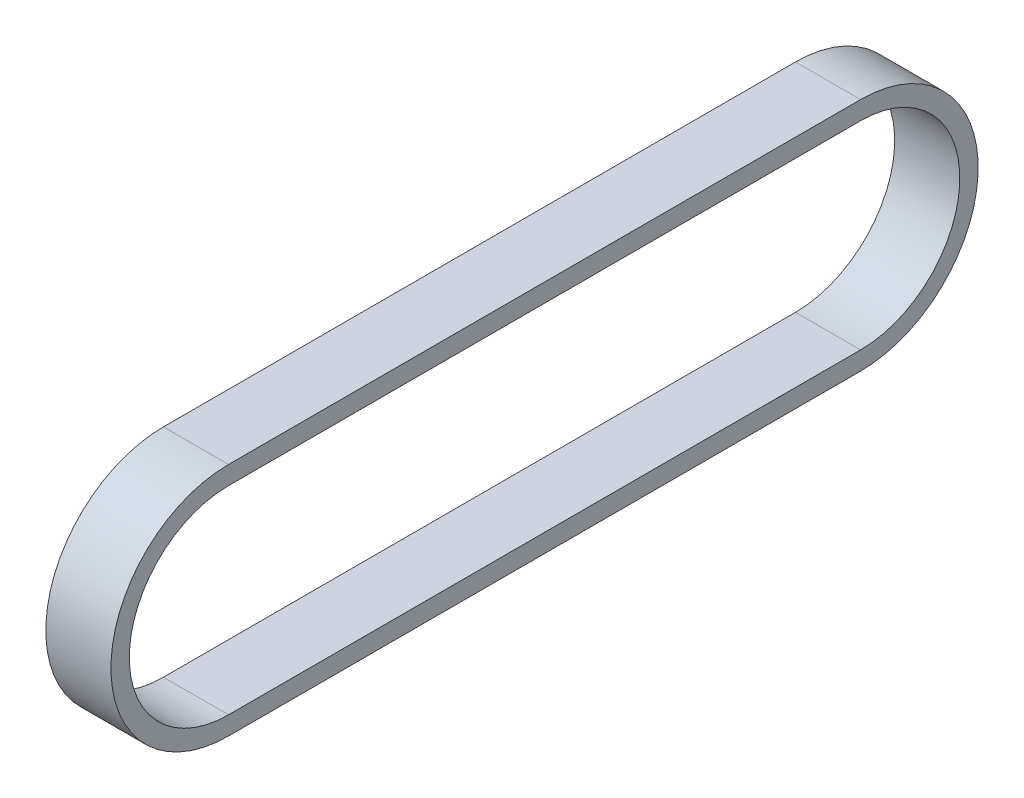
ISO-10303-21;
HEADER;
FILE_DESCRIPTION(('STEP AP214'),'2;1');
FILE_NAME('part.step','',(''),(''),'','','');
FILE_SCHEMA(('AUTOMOTIVE_DESIGN { 1 0 10303 214 1 1 1 1 }'));
ENDSEC;
DATA;
#1=APPLICATION_CONTEXT('core data for automotive mechanical design processes');
#2=APPLICATION_PROTOCOL_DEFINITION('international standard','automotive_design',2000,#1);
#3=PRODUCT_CONTEXT('',#1,'mechanical');
#4=PRODUCT('Part','Part','',(#3));
#5=PRODUCT_RELATED_PRODUCT_CATEGORY('part','',(#4));
#6=PRODUCT_DEFINITION_FORMATION('','',#4);
#7=PRODUCT_DEFINITION_CONTEXT('part definition',#1,'design');
#8=PRODUCT_DEFINITION('design','',#6,#7);
#9=PRODUCT_DEFINITION_SHAPE('','',#8);
#10=(LENGTH_UNIT() NAMED_UNIT(*) SI_UNIT(.MILLI.,.METRE.));
#11=(NAMED_UNIT(*) PLANE_ANGLE_UNIT() SI_UNIT($,.RADIAN.));
#12=(NAMED_UNIT(*) SI_UNIT($,.STERADIAN.) SOLID_ANGLE_UNIT());
#13=UNCERTAINTY_MEASURE_WITH_UNIT(LENGTH_MEASURE(1.E-05),#10,'distance_accuracy_value','');
#14=(GEOMETRIC_REPRESENTATION_CONTEXT(3) GLOBAL_UNCERTAINTY_ASSIGNED_CONTEXT((#13)) GLOBAL_UNIT_ASSIGNED_CONTEXT((#10,
#11,#12)) REPRESENTATION_CONTEXT('',''));
#15=CARTESIAN_POINT('',(0.,0.,0.));
#16=DIRECTION('',(0.,0.,1.));
#17=DIRECTION('',(1.,0.,0.));
#18=AXIS2_PLACEMENT_3D('',#15,#16,#17);
#19=CARTESIAN_POINT('',(9.,0.,0.));
#20=DIRECTION('',(1.,0.,0.));
#21=DIRECTION('',(0.,0.,-1.));
#22=AXIS2_PLACEMENT_3D('',#19,#20,#21);
#23=PLANE('',#22);
#24=CARTESIAN_POINT('',(9.,0.,0.));
#25=DIRECTION('',(1.,0.,0.));
#26=DIRECTION('',(0.,0.,-1.));
#27=AXIS2_PLACEMENT_3D('',#24,#25,#26);
#28=CIRCLE('',#27,16.256);
#29=CARTESIAN_POINT('',(9.,16.256,0.));
#30=VERTEX_POINT('',#29);
#31=CARTESIAN_POINT('',(9.,-16.256,0.));
#32=VERTEX_POINT('',#31);
#33=EDGE_CURVE('E158',#30,#32,#28,.T.);
#34=ORIENTED_EDGE('',*,*,#33,.T.);
#35=DIRECTION('',(0.,0.,-1.));
#36=VECTOR('',#35,1.);
#37=CARTESIAN_POINT('',(9.,-16.256,0.));
#38=LINE('',#37,#36);
#39=CARTESIAN_POINT('',(9.,-16.256,-87.376));
#40=VERTEX_POINT('',#39);
#41=EDGE_CURVE('E161',#32,#40,#38,.T.);
#42=ORIENTED_EDGE('',*,*,#41,.T.);
#43=CARTESIAN_POINT('',(9.,0.,-87.376));
#44=DIRECTION('',(1.,0.,0.));
#45=DIRECTION('',(0.,0.,-1.));
#46=AXIS2_PLACEMENT_3D('',#43,#44,#45);
#47=CIRCLE('',#46,16.256);
#48=CARTESIAN_POINT('',(9.,16.256,-87.376));
#49=VERTEX_POINT('',#48);
#50=EDGE_CURVE('E164',#40,#49,#47,.T.);
#51=ORIENTED_EDGE('',*,*,#50,.T.);
#52=DIRECTION('',(0.,0.,1.));
#53=VECTOR('',#52,1.);
#54=CARTESIAN_POINT('',(9.,16.256,0.));
#55=LINE('',#54,#53);
#56=EDGE_CURVE('E166',#49,#30,#55,.T.);
#57=ORIENTED_EDGE('',*,*,#56,.T.);
#58=EDGE_LOOP('',(#34,#42,#51,#57));
#59=FACE_BOUND('',#58,.T.);
#60=DIRECTION('',(0.,0.,-1.));
#61=VECTOR('',#60,1.);
#62=CARTESIAN_POINT('',(9.,-13.716,0.));
#63=LINE('',#62,#61);
#64=CARTESIAN_POINT('',(9.,-13.716,0.));
#65=VERTEX_POINT('',#64);
#66=CARTESIAN_POINT('',(9.,-13.716,-87.376));
#67=VERTEX_POINT('',#66);
#68=EDGE_CURVE('E130',#65,#67,#63,.T.);
#69=ORIENTED_EDGE('',*,*,#68,.F.);
#70=CARTESIAN_POINT('',(9.,0.,0.));
#71=DIRECTION('',(1.,0.,0.));
#72=DIRECTION('',(0.,0.,-1.));
#73=AXIS2_PLACEMENT_3D('',#70,#71,#72);
#74=CIRCLE('',#73,13.716);
#75=CARTESIAN_POINT('',(9.,13.716,0.));
#76=VERTEX_POINT('',#75);
#77=EDGE_CURVE('E122',#76,#65,#74,.T.);
#78=ORIENTED_EDGE('',*,*,#77,.F.);
#79=DIRECTION('',(0.,0.,1.));
#80=VECTOR('',#79,1.);
#81=CARTESIAN_POINT('',(9.,13.716,0.));
#82=LINE('',#81,#80);
#83=CARTESIAN_POINT('',(9.,13.716,-87.376));
#84=VERTEX_POINT('',#83);
#85=EDGE_CURVE('E144',#84,#76,#82,.T.);
#86=ORIENTED_EDGE('',*,*,#85,.F.);
#87=CARTESIAN_POINT('',(9.,0.,-87.376));
#88=DIRECTION('',(1.,0.,0.));
#89=DIRECTION('',(0.,0.,-1.));
#90=AXIS2_PLACEMENT_3D('',#87,#88,#89);
#91=CIRCLE('',#90,13.716);
#92=EDGE_CURVE('E142',#67,#84,#91,.T.);
#93=ORIENTED_EDGE('',*,*,#92,.F.);
#94=EDGE_LOOP('',(#69,#78,#86,#93));
#95=FACE_BOUND('',#94,.T.);
#96=ADVANCED_FACE('F57',(#59,#95),#23,.T.);
#97=CARTESIAN_POINT('',(0.,0.,0.));
#98=DIRECTION('',(1.,0.,0.));
#99=DIRECTION('',(0.,0.,-1.));
#100=AXIS2_PLACEMENT_3D('',#97,#98,#99);
#101=PLANE('',#100);
#102=CARTESIAN_POINT('',(0.,0.,0.));
#103=DIRECTION('',(1.,0.,0.));
#104=DIRECTION('',(0.,0.,-1.));
#105=AXIS2_PLACEMENT_3D('',#102,#103,#104);
#106=CIRCLE('',#105,16.256);
#107=CARTESIAN_POINT('',(0.,16.256,0.));
#108=VERTEX_POINT('',#107);
#109=CARTESIAN_POINT('',(0.,-16.256,0.));
#110=VERTEX_POINT('',#109);
#111=EDGE_CURVE('E138',#108,#110,#106,.T.);
#112=ORIENTED_EDGE('',*,*,#111,.F.);
#113=DIRECTION('',(0.,0.,1.));
#114=VECTOR('',#113,1.);
#115=CARTESIAN_POINT('',(0.,16.256,0.));
#116=LINE('',#115,#114);
#117=CARTESIAN_POINT('',(0.,16.256,-87.376));
#118=VERTEX_POINT('',#117);
#119=EDGE_CURVE('E162',#118,#108,#116,.T.);
#120=ORIENTED_EDGE('',*,*,#119,.F.);
#121=CARTESIAN_POINT('',(0.,0.,-87.376));
#122=DIRECTION('',(1.,0.,0.));
#123=DIRECTION('',(0.,0.,-1.));
#124=AXIS2_PLACEMENT_3D('',#121,#122,#123);
#125=CIRCLE('',#124,16.256);
#126=CARTESIAN_POINT('',(0.,-16.256,-87.376));
#127=VERTEX_POINT('',#126);
#128=EDGE_CURVE('E173',#127,#118,#125,.T.);
#129=ORIENTED_EDGE('',*,*,#128,.F.);
#130=DIRECTION('',(0.,0.,-1.));
#131=VECTOR('',#130,1.);
#132=CARTESIAN_POINT('',(0.,-16.256,0.));
#133=LINE('',#132,#131);
#134=EDGE_CURVE('E171',#110,#127,#133,.T.);
#135=ORIENTED_EDGE('',*,*,#134,.F.);
#136=EDGE_LOOP('',(#112,#120,#129,#135));
#137=FACE_BOUND('',#136,.T.);
#138=CARTESIAN_POINT('',(0.,0.,0.));
#139=DIRECTION('',(1.,0.,0.));
#140=DIRECTION('',(0.,0.,-1.));
#141=AXIS2_PLACEMENT_3D('',#138,#139,#140);
#142=CIRCLE('',#141,13.716);
#143=CARTESIAN_POINT('',(0.,13.716,0.));
#144=VERTEX_POINT('',#143);
#145=CARTESIAN_POINT('',(0.,-13.716,0.));
#146=VERTEX_POINT('',#145);
#147=EDGE_CURVE('E80',#144,#146,#142,.T.);
#148=ORIENTED_EDGE('',*,*,#147,.T.);
#149=DIRECTION('',(0.,0.,-1.));
#150=VECTOR('',#149,1.);
#151=CARTESIAN_POINT('',(0.,-13.716,0.));
#152=LINE('',#151,#150);
#153=CARTESIAN_POINT('',(0.,-13.716,-87.376));
#154=VERTEX_POINT('',#153);
#155=EDGE_CURVE('E137',#146,#154,#152,.T.);
#156=ORIENTED_EDGE('',*,*,#155,.T.);
#157=CARTESIAN_POINT('',(0.,0.,-87.376));
#158=DIRECTION('',(1.,0.,0.));
#159=DIRECTION('',(0.,0.,-1.));
#160=AXIS2_PLACEMENT_3D('',#157,#158,#159);
#161=CIRCLE('',#160,13.716);
#162=CARTESIAN_POINT('',(0.,13.716,-87.376));
#163=VERTEX_POINT('',#162);
#164=EDGE_CURVE('E150',#154,#163,#161,.T.);
#165=ORIENTED_EDGE('',*,*,#164,.T.);
#166=DIRECTION('',(0.,0.,1.));
#167=VECTOR('',#166,1.);
#168=CARTESIAN_POINT('',(0.,13.716,0.));
#169=LINE('',#168,#167);
#170=EDGE_CURVE('E131',#163,#144,#169,.T.);
#171=ORIENTED_EDGE('',*,*,#170,.T.);
#172=EDGE_LOOP('',(#148,#156,#165,#171));
#173=FACE_BOUND('',#172,.T.);
#174=ADVANCED_FACE('F191',(#137,#173),#101,.F.);
#175=CARTESIAN_POINT('',(9.,0.,0.));
#176=DIRECTION('',(-1.,0.,0.));
#177=DIRECTION('',(0.,0.,1.));
#178=AXIS2_PLACEMENT_3D('',#175,#176,#177);
#179=CYLINDRICAL_SURFACE('',#178,16.256);
#180=ORIENTED_EDGE('',*,*,#111,.T.);
#181=DIRECTION('',(-1.,0.,0.));
#182=VECTOR('',#181,1.);
#183=CARTESIAN_POINT('',(9.,-16.256,0.));
#184=LINE('',#183,#182);
#185=EDGE_CURVE('E12',#32,#110,#184,.T.);
#186=ORIENTED_EDGE('',*,*,#185,.F.);
#187=ORIENTED_EDGE('',*,*,#33,.F.);
#188=DIRECTION('',(-1.,0.,0.));
#189=VECTOR('',#188,1.);
#190=CARTESIAN_POINT('',(9.,16.256,0.));
#191=LINE('',#190,#189);
#192=EDGE_CURVE('E168',#30,#108,#191,.T.);
#193=ORIENTED_EDGE('',*,*,#192,.T.);
#194=EDGE_LOOP('',(#180,#186,#187,#193));
#195=FACE_BOUND('',#194,.T.);
#196=ADVANCED_FACE('F59',(#195),#179,.T.);
#197=CARTESIAN_POINT('',(9.,-16.256,0.));
#198=DIRECTION('',(0.,1.,0.));
#199=DIRECTION('',(0.,0.,1.));
#200=AXIS2_PLACEMENT_3D('',#197,#198,#199);
#201=PLANE('',#200);
#202=ORIENTED_EDGE('',*,*,#134,.T.);
#203=DIRECTION('',(-1.,0.,0.));
#204=VECTOR('',#203,1.);
#205=CARTESIAN_POINT('',(9.,-16.256,-87.376));
#206=LINE('',#205,#204);
#207=EDGE_CURVE('E65',#40,#127,#206,.T.);
#208=ORIENTED_EDGE('',*,*,#207,.F.);
#209=ORIENTED_EDGE('',*,*,#41,.F.);
#210=ORIENTED_EDGE('',*,*,#185,.T.);
#211=EDGE_LOOP('',(#202,#208,#209,#210));
#212=FACE_BOUND('',#211,.T.);
#213=ADVANCED_FACE('F201',(#212),#201,.F.);
#214=CARTESIAN_POINT('',(9.,0.,-87.376));
#215=DIRECTION('',(-1.,0.,0.));
#216=DIRECTION('',(0.,0.,1.));
#217=AXIS2_PLACEMENT_3D('',#214,#215,#216);
#218=CYLINDRICAL_SURFACE('',#217,16.256);
#219=ORIENTED_EDGE('',*,*,#128,.T.);
#220=DIRECTION('',(-1.,0.,0.));
#221=VECTOR('',#220,1.);
#222=CARTESIAN_POINT('',(9.,16.256,-87.376));
#223=LINE('',#222,#221);
#224=EDGE_CURVE('E178',#49,#118,#223,.T.);
#225=ORIENTED_EDGE('',*,*,#224,.F.);
#226=ORIENTED_EDGE('',*,*,#50,.F.);
#227=ORIENTED_EDGE('',*,*,#207,.T.);
#228=EDGE_LOOP('',(#219,#225,#226,#227));
#229=FACE_BOUND('',#228,.T.);
#230=ADVANCED_FACE('F185',(#229),#218,.T.);
#231=CARTESIAN_POINT('',(9.,16.256,0.));
#232=DIRECTION('',(0.,-1.,0.));
#233=DIRECTION('',(0.,0.,-1.));
#234=AXIS2_PLACEMENT_3D('',#231,#232,#233);
#235=PLANE('',#234);
#236=ORIENTED_EDGE('',*,*,#119,.T.);
#237=ORIENTED_EDGE('',*,*,#192,.F.);
#238=ORIENTED_EDGE('',*,*,#56,.F.);
#239=ORIENTED_EDGE('',*,*,#224,.T.);
#240=EDGE_LOOP('',(#236,#237,#238,#239));
#241=FACE_BOUND('',#240,.T.);
#242=ADVANCED_FACE('F195',(#241),#235,.F.);
#243=CARTESIAN_POINT('',(9.,0.,0.));
#244=DIRECTION('',(-1.,0.,0.));
#245=DIRECTION('',(0.,0.,1.));
#246=AXIS2_PLACEMENT_3D('',#243,#244,#245);
#247=CYLINDRICAL_SURFACE('',#246,13.716);
#248=ORIENTED_EDGE('',*,*,#147,.F.);
#249=DIRECTION('',(-1.,0.,0.));
#250=VECTOR('',#249,1.);
#251=CARTESIAN_POINT('',(9.,13.716,0.));
#252=LINE('',#251,#250);
#253=EDGE_CURVE('E126',#76,#144,#252,.T.);
#254=ORIENTED_EDGE('',*,*,#253,.F.);
#255=ORIENTED_EDGE('',*,*,#77,.T.);
#256=DIRECTION('',(-1.,0.,0.));
#257=VECTOR('',#256,1.);
#258=CARTESIAN_POINT('',(9.,-13.716,0.));
#259=LINE('',#258,#257);
#260=EDGE_CURVE('E125',#65,#146,#259,.T.);
#261=ORIENTED_EDGE('',*,*,#260,.T.);
#262=EDGE_LOOP('',(#248,#254,#255,#261));
#263=FACE_BOUND('',#262,.T.);
#264=ADVANCED_FACE('F124',(#263),#247,.F.);
#265=CARTESIAN_POINT('',(9.,-13.716,0.));
#266=DIRECTION('',(0.,1.,0.));
#267=DIRECTION('',(0.,0.,1.));
#268=AXIS2_PLACEMENT_3D('',#265,#266,#267);
#269=PLANE('',#268);
#270=ORIENTED_EDGE('',*,*,#155,.F.);
#271=ORIENTED_EDGE('',*,*,#260,.F.);
#272=ORIENTED_EDGE('',*,*,#68,.T.);
#273=DIRECTION('',(-1.,0.,0.));
#274=VECTOR('',#273,1.);
#275=CARTESIAN_POINT('',(9.,-13.716,-87.376));
#276=LINE('',#275,#274);
#277=EDGE_CURVE('E139',#67,#154,#276,.T.);
#278=ORIENTED_EDGE('',*,*,#277,.T.);
#279=EDGE_LOOP('',(#270,#271,#272,#278));
#280=FACE_BOUND('',#279,.T.);
#281=ADVANCED_FACE('F134',(#280),#269,.T.);
#282=CARTESIAN_POINT('',(9.,0.,-87.376));
#283=DIRECTION('',(-1.,0.,0.));
#284=DIRECTION('',(0.,0.,1.));
#285=AXIS2_PLACEMENT_3D('',#282,#283,#284);
#286=CYLINDRICAL_SURFACE('',#285,13.716);
#287=ORIENTED_EDGE('',*,*,#164,.F.);
#288=ORIENTED_EDGE('',*,*,#277,.F.);
#289=ORIENTED_EDGE('',*,*,#92,.T.);
#290=DIRECTION('',(-1.,0.,0.));
#291=VECTOR('',#290,1.);
#292=CARTESIAN_POINT('',(9.,13.716,-87.376));
#293=LINE('',#292,#291);
#294=EDGE_CURVE('E72',#84,#163,#293,.T.);
#295=ORIENTED_EDGE('',*,*,#294,.T.);
#296=EDGE_LOOP('',(#287,#288,#289,#295));
#297=FACE_BOUND('',#296,.T.);
#298=ADVANCED_FACE('F224',(#297),#286,.F.);
#299=CARTESIAN_POINT('',(9.,13.716,0.));
#300=DIRECTION('',(0.,-1.,0.));
#301=DIRECTION('',(0.,0.,-1.));
#302=AXIS2_PLACEMENT_3D('',#299,#300,#301);
#303=PLANE('',#302);
#304=ORIENTED_EDGE('',*,*,#170,.F.);
#305=ORIENTED_EDGE('',*,*,#294,.F.);
#306=ORIENTED_EDGE('',*,*,#85,.T.);
#307=ORIENTED_EDGE('',*,*,#253,.T.);
#308=EDGE_LOOP('',(#304,#305,#306,#307));
#309=FACE_BOUND('',#308,.T.);
#310=ADVANCED_FACE('F228',(#309),#303,.T.);
#311=CLOSED_SHELL('',(#96,#174,#196,#213,#230,#242,#264,#281,#298,#310));
#312=MANIFOLD_SOLID_BREP('B2',#311);
#313=ADVANCED_BREP_SHAPE_REPRESENTATION('',(#18,#312),#14);
#314=SHAPE_DEFINITION_REPRESENTATION(#9,#313);
ENDSEC;
END-ISO-10303-21;
